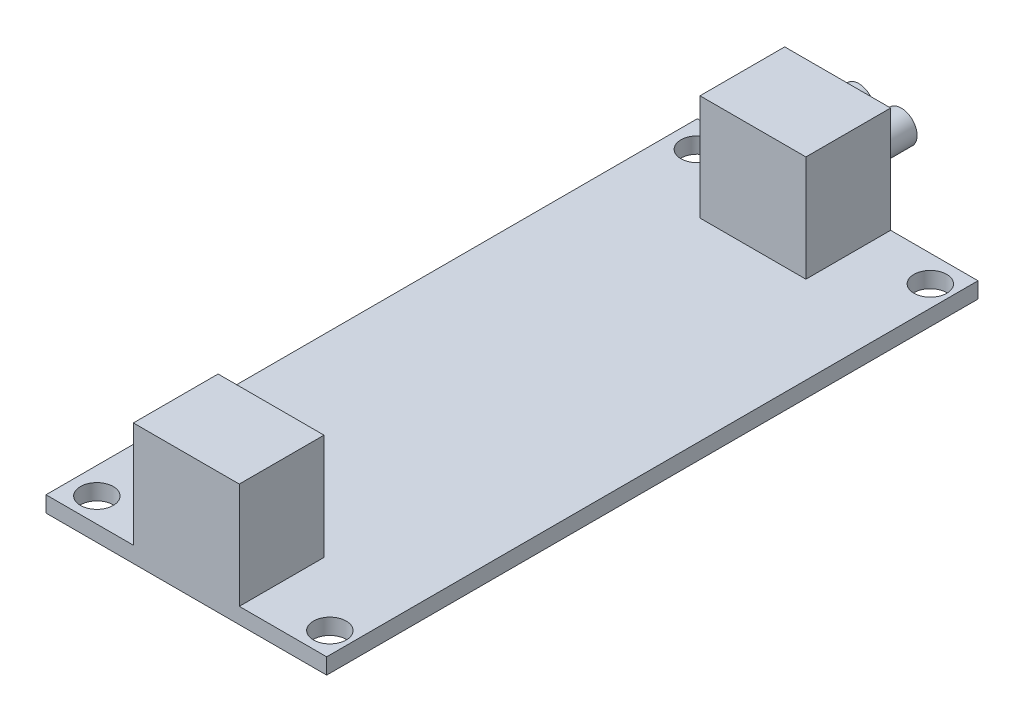
ISO-10303-21;
HEADER;
FILE_DESCRIPTION(('STEP AP214'),'2;1');
FILE_NAME('part.step','',(''),(''),'','','');
FILE_SCHEMA(('AUTOMOTIVE_DESIGN { 1 0 10303 214 1 1 1 1 }'));
ENDSEC;
DATA;
#1=APPLICATION_CONTEXT('core data for automotive mechanical design processes');
#2=APPLICATION_PROTOCOL_DEFINITION('international standard','automotive_design',2000,#1);
#3=PRODUCT_CONTEXT('',#1,'mechanical');
#4=PRODUCT('Part','Part','',(#3));
#5=PRODUCT_RELATED_PRODUCT_CATEGORY('part','',(#4));
#6=PRODUCT_DEFINITION_FORMATION('','',#4);
#7=PRODUCT_DEFINITION_CONTEXT('part definition',#1,'design');
#8=PRODUCT_DEFINITION('design','',#6,#7);
#9=PRODUCT_DEFINITION_SHAPE('','',#8);
#10=(LENGTH_UNIT() NAMED_UNIT(*) SI_UNIT(.MILLI.,.METRE.));
#11=(NAMED_UNIT(*) PLANE_ANGLE_UNIT() SI_UNIT($,.RADIAN.));
#12=(NAMED_UNIT(*) SI_UNIT($,.STERADIAN.) SOLID_ANGLE_UNIT());
#13=UNCERTAINTY_MEASURE_WITH_UNIT(LENGTH_MEASURE(1.E-05),#10,'distance_accuracy_value','');
#14=(GEOMETRIC_REPRESENTATION_CONTEXT(3) GLOBAL_UNCERTAINTY_ASSIGNED_CONTEXT((#13)) GLOBAL_UNIT_ASSIGNED_CONTEXT((#10,
#11,#12)) REPRESENTATION_CONTEXT('',''));
#15=CARTESIAN_POINT('',(0.,0.,0.));
#16=DIRECTION('',(0.,0.,1.));
#17=DIRECTION('',(1.,0.,0.));
#18=AXIS2_PLACEMENT_3D('',#15,#16,#17);
#19=CARTESIAN_POINT('',(0.,1.5,0.));
#20=DIRECTION('',(0.,1.,0.));
#21=DIRECTION('',(0.,0.,1.));
#22=AXIS2_PLACEMENT_3D('',#19,#20,#21);
#23=PLANE('',#22);
#24=CARTESIAN_POINT('',(-10.75,1.5,-28.25));
#25=DIRECTION('',(0.,1.,0.));
#26=DIRECTION('',(0.,0.,1.));
#27=AXIS2_PLACEMENT_3D('',#24,#25,#26);
#28=CIRCLE('',#27,1.55);
#29=CARTESIAN_POINT('',(-10.75,1.5,-26.7));
#30=VERTEX_POINT('',#29);
#31=EDGE_CURVE('E201',#30,#30,#28,.T.);
#32=ORIENTED_EDGE('',*,*,#31,.F.);
#33=EDGE_LOOP('',(#32));
#34=FACE_BOUND('',#33,.T.);
#35=CARTESIAN_POINT('',(11.25,1.5,28.45));
#36=DIRECTION('',(0.,1.,0.));
#37=DIRECTION('',(0.,0.,1.));
#38=AXIS2_PLACEMENT_3D('',#35,#36,#37);
#39=CIRCLE('',#38,1.55);
#40=CARTESIAN_POINT('',(11.25,1.5,30.));
#41=VERTEX_POINT('',#40);
#42=EDGE_CURVE('E207',#41,#41,#39,.T.);
#43=ORIENTED_EDGE('',*,*,#42,.F.);
#44=EDGE_LOOP('',(#43));
#45=FACE_BOUND('',#44,.T.);
#46=CARTESIAN_POINT('',(-10.75,1.5,28.45));
#47=DIRECTION('',(0.,1.,0.));
#48=DIRECTION('',(0.,0.,1.));
#49=AXIS2_PLACEMENT_3D('',#46,#47,#48);
#50=CIRCLE('',#49,1.55);
#51=CARTESIAN_POINT('',(-10.75,1.5,30.));
#52=VERTEX_POINT('',#51);
#53=EDGE_CURVE('E196',#52,#52,#50,.T.);
#54=ORIENTED_EDGE('',*,*,#53,.F.);
#55=EDGE_LOOP('',(#54));
#56=FACE_BOUND('',#55,.T.);
#57=CARTESIAN_POINT('',(11.25,1.5,-28.25));
#58=DIRECTION('',(0.,1.,0.));
#59=DIRECTION('',(0.,0.,1.));
#60=AXIS2_PLACEMENT_3D('',#57,#58,#59);
#61=CIRCLE('',#60,1.55);
#62=CARTESIAN_POINT('',(11.25,1.5,-26.7));
#63=VERTEX_POINT('',#62);
#64=EDGE_CURVE('E200',#63,#63,#61,.T.);
#65=ORIENTED_EDGE('',*,*,#64,.F.);
#66=EDGE_LOOP('',(#65));
#67=FACE_BOUND('',#66,.T.);
#68=DIRECTION('',(1.,0.,0.));
#69=VECTOR('',#68,1.);
#70=CARTESIAN_POINT('',(5.,1.5,-22.75));
#71=LINE('',#70,#69);
#72=CARTESIAN_POINT('',(-5.,1.5,-22.75));
#73=VERTEX_POINT('',#72);
#74=CARTESIAN_POINT('',(5.,1.5,-22.75));
#75=VERTEX_POINT('',#74);
#76=EDGE_CURVE('E66',#73,#75,#71,.T.);
#77=ORIENTED_EDGE('',*,*,#76,.F.);
#78=DIRECTION('',(0.,0.,1.));
#79=VECTOR('',#78,1.);
#80=CARTESIAN_POINT('',(-5.,1.5,-22.75));
#81=LINE('',#80,#79);
#82=CARTESIAN_POINT('',(-5.,1.5,-30.75));
#83=VERTEX_POINT('',#82);
#84=EDGE_CURVE('E160',#83,#73,#81,.T.);
#85=ORIENTED_EDGE('',*,*,#84,.F.);
#86=DIRECTION('',(-1.,0.,0.));
#87=VECTOR('',#86,1.);
#88=CARTESIAN_POINT('',(-13.25,1.5,-30.75));
#89=LINE('',#88,#87);
#90=CARTESIAN_POINT('',(-13.25,1.5,-30.75));
#91=VERTEX_POINT('',#90);
#92=EDGE_CURVE('E224',#83,#91,#89,.T.);
#93=ORIENTED_EDGE('',*,*,#92,.T.);
#94=DIRECTION('',(0.,0.,1.));
#95=VECTOR('',#94,1.);
#96=CARTESIAN_POINT('',(-13.25,1.5,-30.75));
#97=LINE('',#96,#95);
#98=CARTESIAN_POINT('',(-13.25,1.5,30.75));
#99=VERTEX_POINT('',#98);
#100=EDGE_CURVE('E228',#91,#99,#97,.T.);
#101=ORIENTED_EDGE('',*,*,#100,.T.);
#102=DIRECTION('',(1.,0.,0.));
#103=VECTOR('',#102,1.);
#104=CARTESIAN_POINT('',(-13.25,1.5,30.75));
#105=LINE('',#104,#103);
#106=CARTESIAN_POINT('',(-5.,1.5,30.75));
#107=VERTEX_POINT('',#106);
#108=EDGE_CURVE('E231',#99,#107,#105,.T.);
#109=ORIENTED_EDGE('',*,*,#108,.T.);
#110=DIRECTION('',(0.,0.,1.));
#111=VECTOR('',#110,1.);
#112=CARTESIAN_POINT('',(-5.,1.5,22.75));
#113=LINE('',#112,#111);
#114=CARTESIAN_POINT('',(-5.,1.5,22.75));
#115=VERTEX_POINT('',#114);
#116=EDGE_CURVE('E161',#115,#107,#113,.T.);
#117=ORIENTED_EDGE('',*,*,#116,.F.);
#118=DIRECTION('',(-1.,0.,0.));
#119=VECTOR('',#118,1.);
#120=CARTESIAN_POINT('',(5.,1.5,22.75));
#121=LINE('',#120,#119);
#122=CARTESIAN_POINT('',(5.,1.5,22.75));
#123=VERTEX_POINT('',#122);
#124=EDGE_CURVE('E174',#123,#115,#121,.T.);
#125=ORIENTED_EDGE('',*,*,#124,.F.);
#126=DIRECTION('',(0.,0.,-1.));
#127=VECTOR('',#126,1.);
#128=CARTESIAN_POINT('',(5.,1.5,22.75));
#129=LINE('',#128,#127);
#130=CARTESIAN_POINT('',(5.,1.5,30.75));
#131=VERTEX_POINT('',#130);
#132=EDGE_CURVE('E164',#131,#123,#129,.T.);
#133=ORIENTED_EDGE('',*,*,#132,.F.);
#134=CARTESIAN_POINT('',(13.25,1.5,30.75));
#135=VERTEX_POINT('',#134);
#136=EDGE_CURVE('E230',#131,#135,#105,.T.);
#137=ORIENTED_EDGE('',*,*,#136,.T.);
#138=DIRECTION('',(0.,0.,-1.));
#139=VECTOR('',#138,1.);
#140=CARTESIAN_POINT('',(13.25,1.5,-30.75));
#141=LINE('',#140,#139);
#142=CARTESIAN_POINT('',(13.25,1.5,-30.75));
#143=VERTEX_POINT('',#142);
#144=EDGE_CURVE('E221',#135,#143,#141,.T.);
#145=ORIENTED_EDGE('',*,*,#144,.T.);
#146=CARTESIAN_POINT('',(5.,1.5,-30.75));
#147=VERTEX_POINT('',#146);
#148=EDGE_CURVE('E226',#143,#147,#89,.T.);
#149=ORIENTED_EDGE('',*,*,#148,.T.);
#150=DIRECTION('',(0.,0.,-1.));
#151=VECTOR('',#150,1.);
#152=CARTESIAN_POINT('',(5.,1.5,-22.75));
#153=LINE('',#152,#151);
#154=EDGE_CURVE('E71',#75,#147,#153,.T.);
#155=ORIENTED_EDGE('',*,*,#154,.F.);
#156=EDGE_LOOP('',(#77,#85,#93,#101,#109,#117,#125,#133,#137,#145,#149,#155));
#157=FACE_BOUND('',#156,.T.);
#158=ADVANCED_FACE('F51',(#34,#45,#56,#67,#157),#23,.T.);
#159=CARTESIAN_POINT('',(13.25,1.5,-30.75));
#160=DIRECTION('',(-1.,0.,0.));
#161=DIRECTION('',(0.,0.,1.));
#162=AXIS2_PLACEMENT_3D('',#159,#160,#161);
#163=PLANE('',#162);
#164=DIRECTION('',(0.,0.,-1.));
#165=VECTOR('',#164,1.);
#166=CARTESIAN_POINT('',(13.25,0.,-30.75));
#167=LINE('',#166,#165);
#168=CARTESIAN_POINT('',(13.25,0.,30.75));
#169=VERTEX_POINT('',#168);
#170=CARTESIAN_POINT('',(13.25,0.,-30.75));
#171=VERTEX_POINT('',#170);
#172=EDGE_CURVE('E218',#169,#171,#167,.T.);
#173=ORIENTED_EDGE('',*,*,#172,.T.);
#174=DIRECTION('',(0.,-1.,0.));
#175=VECTOR('',#174,1.);
#176=CARTESIAN_POINT('',(13.25,1.5,-30.75));
#177=LINE('',#176,#175);
#178=EDGE_CURVE('E249',#143,#171,#177,.T.);
#179=ORIENTED_EDGE('',*,*,#178,.F.);
#180=ORIENTED_EDGE('',*,*,#144,.F.);
#181=DIRECTION('',(0.,-1.,0.));
#182=VECTOR('',#181,1.);
#183=CARTESIAN_POINT('',(13.25,1.5,30.75));
#184=LINE('',#183,#182);
#185=EDGE_CURVE('E233',#135,#169,#184,.T.);
#186=ORIENTED_EDGE('',*,*,#185,.T.);
#187=EDGE_LOOP('',(#173,#179,#180,#186));
#188=FACE_BOUND('',#187,.T.);
#189=ADVANCED_FACE('F53',(#188),#163,.F.);
#190=CARTESIAN_POINT('',(-13.25,1.5,-30.75));
#191=DIRECTION('',(0.,0.,1.));
#192=DIRECTION('',(1.,0.,0.));
#193=AXIS2_PLACEMENT_3D('',#190,#191,#192);
#194=PLANE('',#193);
#195=CARTESIAN_POINT('',(-2.,6.5,-30.75));
#196=DIRECTION('',(0.,0.,1.));
#197=DIRECTION('',(1.,0.,0.));
#198=AXIS2_PLACEMENT_3D('',#195,#196,#197);
#199=CIRCLE('',#198,1.5);
#200=CARTESIAN_POINT('',(-0.5,6.5,-30.75));
#201=VERTEX_POINT('',#200);
#202=EDGE_CURVE('E13',#201,#201,#199,.F.);
#203=ORIENTED_EDGE('',*,*,#202,.F.);
#204=EDGE_LOOP('',(#203));
#205=FACE_BOUND('',#204,.T.);
#206=CARTESIAN_POINT('',(2.,6.5,-30.75));
#207=DIRECTION('',(0.,0.,1.));
#208=DIRECTION('',(1.,0.,0.));
#209=AXIS2_PLACEMENT_3D('',#206,#207,#208);
#210=CIRCLE('',#209,1.5);
#211=CARTESIAN_POINT('',(3.5,6.5,-30.75));
#212=VERTEX_POINT('',#211);
#213=EDGE_CURVE('E59',#212,#212,#210,.F.);
#214=ORIENTED_EDGE('',*,*,#213,.F.);
#215=EDGE_LOOP('',(#214));
#216=FACE_BOUND('',#215,.T.);
#217=DIRECTION('',(-1.,0.,0.));
#218=VECTOR('',#217,1.);
#219=CARTESIAN_POINT('',(-13.25,0.,-30.75));
#220=LINE('',#219,#218);
#221=CARTESIAN_POINT('',(-13.25,0.,-30.75));
#222=VERTEX_POINT('',#221);
#223=EDGE_CURVE('E236',#171,#222,#220,.T.);
#224=ORIENTED_EDGE('',*,*,#223,.T.);
#225=DIRECTION('',(0.,-1.,0.));
#226=VECTOR('',#225,1.);
#227=CARTESIAN_POINT('',(-13.25,1.5,-30.75));
#228=LINE('',#227,#226);
#229=EDGE_CURVE('E246',#91,#222,#228,.T.);
#230=ORIENTED_EDGE('',*,*,#229,.F.);
#231=ORIENTED_EDGE('',*,*,#92,.F.);
#232=DIRECTION('',(0.,-1.,0.));
#233=VECTOR('',#232,1.);
#234=CARTESIAN_POINT('',(-5.,11.5,-30.75));
#235=LINE('',#234,#233);
#236=CARTESIAN_POINT('',(-5.,11.5,-30.75));
#237=VERTEX_POINT('',#236);
#238=EDGE_CURVE('E474',#237,#83,#235,.T.);
#239=ORIENTED_EDGE('',*,*,#238,.F.);
#240=DIRECTION('',(-1.,0.,0.));
#241=VECTOR('',#240,1.);
#242=CARTESIAN_POINT('',(5.,11.5,-30.75));
#243=LINE('',#242,#241);
#244=CARTESIAN_POINT('',(5.,11.5,-30.75));
#245=VERTEX_POINT('',#244);
#246=EDGE_CURVE('E154',#245,#237,#243,.T.);
#247=ORIENTED_EDGE('',*,*,#246,.F.);
#248=DIRECTION('',(0.,-1.,0.));
#249=VECTOR('',#248,1.);
#250=CARTESIAN_POINT('',(5.,11.5,-30.75));
#251=LINE('',#250,#249);
#252=EDGE_CURVE('E166',#245,#147,#251,.T.);
#253=ORIENTED_EDGE('',*,*,#252,.T.);
#254=ORIENTED_EDGE('',*,*,#148,.F.);
#255=ORIENTED_EDGE('',*,*,#178,.T.);
#256=EDGE_LOOP('',(#224,#230,#231,#239,#247,#253,#254,#255));
#257=FACE_BOUND('',#256,.T.);
#258=ADVANCED_FACE('F256',(#205,#216,#257),#194,.F.);
#259=CARTESIAN_POINT('',(-13.25,1.5,-30.75));
#260=DIRECTION('',(1.,0.,0.));
#261=DIRECTION('',(0.,0.,-1.));
#262=AXIS2_PLACEMENT_3D('',#259,#260,#261);
#263=PLANE('',#262);
#264=DIRECTION('',(0.,0.,1.));
#265=VECTOR('',#264,1.);
#266=CARTESIAN_POINT('',(-13.25,0.,-30.75));
#267=LINE('',#266,#265);
#268=CARTESIAN_POINT('',(-13.25,0.,30.75));
#269=VERTEX_POINT('',#268);
#270=EDGE_CURVE('E238',#222,#269,#267,.T.);
#271=ORIENTED_EDGE('',*,*,#270,.T.);
#272=DIRECTION('',(0.,-1.,0.));
#273=VECTOR('',#272,1.);
#274=CARTESIAN_POINT('',(-13.25,1.5,30.75));
#275=LINE('',#274,#273);
#276=EDGE_CURVE('E243',#99,#269,#275,.T.);
#277=ORIENTED_EDGE('',*,*,#276,.F.);
#278=ORIENTED_EDGE('',*,*,#100,.F.);
#279=ORIENTED_EDGE('',*,*,#229,.T.);
#280=EDGE_LOOP('',(#271,#277,#278,#279));
#281=FACE_BOUND('',#280,.T.);
#282=ADVANCED_FACE('F259',(#281),#263,.F.);
#283=CARTESIAN_POINT('',(-13.25,1.5,30.75));
#284=DIRECTION('',(0.,0.,-1.));
#285=DIRECTION('',(-1.,0.,0.));
#286=AXIS2_PLACEMENT_3D('',#283,#284,#285);
#287=PLANE('',#286);
#288=DIRECTION('',(1.,0.,0.));
#289=VECTOR('',#288,1.);
#290=CARTESIAN_POINT('',(-13.25,0.,30.75));
#291=LINE('',#290,#289);
#292=EDGE_CURVE('E225',#269,#169,#291,.T.);
#293=ORIENTED_EDGE('',*,*,#292,.T.);
#294=ORIENTED_EDGE('',*,*,#185,.F.);
#295=ORIENTED_EDGE('',*,*,#136,.F.);
#296=DIRECTION('',(0.,-1.,0.));
#297=VECTOR('',#296,1.);
#298=CARTESIAN_POINT('',(5.,11.5,30.75));
#299=LINE('',#298,#297);
#300=CARTESIAN_POINT('',(5.,11.5,30.75));
#301=VERTEX_POINT('',#300);
#302=EDGE_CURVE('E190',#301,#131,#299,.T.);
#303=ORIENTED_EDGE('',*,*,#302,.F.);
#304=DIRECTION('',(1.,0.,0.));
#305=VECTOR('',#304,1.);
#306=CARTESIAN_POINT('',(5.,11.5,30.75));
#307=LINE('',#306,#305);
#308=CARTESIAN_POINT('',(-5.,11.5,30.75));
#309=VERTEX_POINT('',#308);
#310=EDGE_CURVE('E173',#309,#301,#307,.T.);
#311=ORIENTED_EDGE('',*,*,#310,.F.);
#312=DIRECTION('',(0.,-1.,0.));
#313=VECTOR('',#312,1.);
#314=CARTESIAN_POINT('',(-5.,11.5,30.75));
#315=LINE('',#314,#313);
#316=EDGE_CURVE('E193',#309,#107,#315,.T.);
#317=ORIENTED_EDGE('',*,*,#316,.T.);
#318=ORIENTED_EDGE('',*,*,#108,.F.);
#319=ORIENTED_EDGE('',*,*,#276,.T.);
#320=EDGE_LOOP('',(#293,#294,#295,#303,#311,#317,#318,#319));
#321=FACE_BOUND('',#320,.T.);
#322=ADVANCED_FACE('F273',(#321),#287,.F.);
#323=CARTESIAN_POINT('',(0.,0.,0.));
#324=DIRECTION('',(0.,1.,0.));
#325=DIRECTION('',(0.,0.,1.));
#326=AXIS2_PLACEMENT_3D('',#323,#324,#325);
#327=PLANE('',#326);
#328=CARTESIAN_POINT('',(-10.75,0.,-28.25));
#329=DIRECTION('',(0.,1.,0.));
#330=DIRECTION('',(0.,0.,1.));
#331=AXIS2_PLACEMENT_3D('',#328,#329,#330);
#332=CIRCLE('',#331,1.55);
#333=CARTESIAN_POINT('',(-10.75,0.,-26.7));
#334=VERTEX_POINT('',#333);
#335=EDGE_CURVE('E197',#334,#334,#332,.T.);
#336=ORIENTED_EDGE('',*,*,#335,.T.);
#337=EDGE_LOOP('',(#336));
#338=FACE_BOUND('',#337,.T.);
#339=CARTESIAN_POINT('',(11.25,0.,28.45));
#340=DIRECTION('',(0.,1.,0.));
#341=DIRECTION('',(0.,0.,1.));
#342=AXIS2_PLACEMENT_3D('',#339,#340,#341);
#343=CIRCLE('',#342,1.55);
#344=CARTESIAN_POINT('',(11.25,0.,30.));
#345=VERTEX_POINT('',#344);
#346=EDGE_CURVE('E204',#345,#345,#343,.T.);
#347=ORIENTED_EDGE('',*,*,#346,.T.);
#348=EDGE_LOOP('',(#347));
#349=FACE_BOUND('',#348,.T.);
#350=CARTESIAN_POINT('',(-10.75,0.,28.45));
#351=DIRECTION('',(0.,1.,0.));
#352=DIRECTION('',(0.,0.,1.));
#353=AXIS2_PLACEMENT_3D('',#350,#351,#352);
#354=CIRCLE('',#353,1.55);
#355=CARTESIAN_POINT('',(-10.75,0.,30.));
#356=VERTEX_POINT('',#355);
#357=EDGE_CURVE('E210',#356,#356,#354,.T.);
#358=ORIENTED_EDGE('',*,*,#357,.T.);
#359=EDGE_LOOP('',(#358));
#360=FACE_BOUND('',#359,.T.);
#361=CARTESIAN_POINT('',(11.25,0.,-28.25));
#362=DIRECTION('',(0.,1.,0.));
#363=DIRECTION('',(0.,0.,1.));
#364=AXIS2_PLACEMENT_3D('',#361,#362,#363);
#365=CIRCLE('',#364,1.55);
#366=CARTESIAN_POINT('',(11.25,0.,-26.7));
#367=VERTEX_POINT('',#366);
#368=EDGE_CURVE('E215',#367,#367,#365,.T.);
#369=ORIENTED_EDGE('',*,*,#368,.T.);
#370=EDGE_LOOP('',(#369));
#371=FACE_BOUND('',#370,.T.);
#372=ORIENTED_EDGE('',*,*,#172,.F.);
#373=ORIENTED_EDGE('',*,*,#292,.F.);
#374=ORIENTED_EDGE('',*,*,#270,.F.);
#375=ORIENTED_EDGE('',*,*,#223,.F.);
#376=EDGE_LOOP('',(#372,#373,#374,#375));
#377=FACE_BOUND('',#376,.T.);
#378=ADVANCED_FACE('F270',(#338,#349,#360,#371,#377),#327,.F.);
#379=CARTESIAN_POINT('',(11.25,0.,-28.25));
#380=DIRECTION('',(0.,1.,0.));
#381=DIRECTION('',(0.,0.,1.));
#382=AXIS2_PLACEMENT_3D('',#379,#380,#381);
#383=CYLINDRICAL_SURFACE('',#382,1.55);
#384=ORIENTED_EDGE('',*,*,#368,.F.);
#385=EDGE_LOOP('',(#384));
#386=FACE_BOUND('',#385,.T.);
#387=ORIENTED_EDGE('',*,*,#64,.T.);
#388=EDGE_LOOP('',(#387));
#389=FACE_BOUND('',#388,.T.);
#390=ADVANCED_FACE('F311',(#386,#389),#383,.F.);
#391=CARTESIAN_POINT('',(-10.75,0.,28.45));
#392=DIRECTION('',(0.,1.,0.));
#393=DIRECTION('',(0.,0.,1.));
#394=AXIS2_PLACEMENT_3D('',#391,#392,#393);
#395=CYLINDRICAL_SURFACE('',#394,1.55);
#396=ORIENTED_EDGE('',*,*,#357,.F.);
#397=EDGE_LOOP('',(#396));
#398=FACE_BOUND('',#397,.T.);
#399=ORIENTED_EDGE('',*,*,#53,.T.);
#400=EDGE_LOOP('',(#399));
#401=FACE_BOUND('',#400,.T.);
#402=ADVANCED_FACE('F339',(#398,#401),#395,.F.);
#403=CARTESIAN_POINT('',(11.25,0.,28.45));
#404=DIRECTION('',(0.,1.,0.));
#405=DIRECTION('',(0.,0.,1.));
#406=AXIS2_PLACEMENT_3D('',#403,#404,#405);
#407=CYLINDRICAL_SURFACE('',#406,1.55);
#408=ORIENTED_EDGE('',*,*,#346,.F.);
#409=EDGE_LOOP('',(#408));
#410=FACE_BOUND('',#409,.T.);
#411=ORIENTED_EDGE('',*,*,#42,.T.);
#412=EDGE_LOOP('',(#411));
#413=FACE_BOUND('',#412,.T.);
#414=ADVANCED_FACE('F346',(#410,#413),#407,.F.);
#415=CARTESIAN_POINT('',(-10.75,0.,-28.25));
#416=DIRECTION('',(0.,1.,0.));
#417=DIRECTION('',(0.,0.,1.));
#418=AXIS2_PLACEMENT_3D('',#415,#416,#417);
#419=CYLINDRICAL_SURFACE('',#418,1.55);
#420=ORIENTED_EDGE('',*,*,#335,.F.);
#421=EDGE_LOOP('',(#420));
#422=FACE_BOUND('',#421,.T.);
#423=ORIENTED_EDGE('',*,*,#31,.T.);
#424=EDGE_LOOP('',(#423));
#425=FACE_BOUND('',#424,.T.);
#426=ADVANCED_FACE('F353',(#422,#425),#419,.F.);
#427=CARTESIAN_POINT('',(-5.,11.5,22.75));
#428=DIRECTION('',(1.,0.,0.));
#429=DIRECTION('',(0.,0.,-1.));
#430=AXIS2_PLACEMENT_3D('',#427,#428,#429);
#431=PLANE('',#430);
#432=ORIENTED_EDGE('',*,*,#116,.T.);
#433=ORIENTED_EDGE('',*,*,#316,.F.);
#434=DIRECTION('',(0.,0.,1.));
#435=VECTOR('',#434,1.);
#436=CARTESIAN_POINT('',(-5.,11.5,22.75));
#437=LINE('',#436,#435);
#438=CARTESIAN_POINT('',(-5.,11.5,22.75));
#439=VERTEX_POINT('',#438);
#440=EDGE_CURVE('E170',#439,#309,#437,.T.);
#441=ORIENTED_EDGE('',*,*,#440,.F.);
#442=DIRECTION('',(0.,-1.,0.));
#443=VECTOR('',#442,1.);
#444=CARTESIAN_POINT('',(-5.,11.5,22.75));
#445=LINE('',#444,#443);
#446=EDGE_CURVE('E179',#439,#115,#445,.T.);
#447=ORIENTED_EDGE('',*,*,#446,.T.);
#448=EDGE_LOOP('',(#432,#433,#441,#447));
#449=FACE_BOUND('',#448,.T.);
#450=ADVANCED_FACE('F290',(#449),#431,.F.);
#451=CARTESIAN_POINT('',(5.,11.5,22.75));
#452=DIRECTION('',(-1.,0.,0.));
#453=DIRECTION('',(0.,0.,1.));
#454=AXIS2_PLACEMENT_3D('',#451,#452,#453);
#455=PLANE('',#454);
#456=ORIENTED_EDGE('',*,*,#132,.T.);
#457=DIRECTION('',(0.,-1.,0.));
#458=VECTOR('',#457,1.);
#459=CARTESIAN_POINT('',(5.,11.5,22.75));
#460=LINE('',#459,#458);
#461=CARTESIAN_POINT('',(5.,11.5,22.75));
#462=VERTEX_POINT('',#461);
#463=EDGE_CURVE('E187',#462,#123,#460,.T.);
#464=ORIENTED_EDGE('',*,*,#463,.F.);
#465=DIRECTION('',(0.,0.,-1.));
#466=VECTOR('',#465,1.);
#467=CARTESIAN_POINT('',(5.,11.5,22.75));
#468=LINE('',#467,#466);
#469=EDGE_CURVE('E176',#301,#462,#468,.T.);
#470=ORIENTED_EDGE('',*,*,#469,.F.);
#471=ORIENTED_EDGE('',*,*,#302,.T.);
#472=EDGE_LOOP('',(#456,#464,#470,#471));
#473=FACE_BOUND('',#472,.T.);
#474=ADVANCED_FACE('F281',(#473),#455,.F.);
#475=CARTESIAN_POINT('',(5.,11.5,22.75));
#476=DIRECTION('',(0.,0.,1.));
#477=DIRECTION('',(1.,0.,0.));
#478=AXIS2_PLACEMENT_3D('',#475,#476,#477);
#479=PLANE('',#478);
#480=ORIENTED_EDGE('',*,*,#124,.T.);
#481=ORIENTED_EDGE('',*,*,#446,.F.);
#482=DIRECTION('',(-1.,0.,0.));
#483=VECTOR('',#482,1.);
#484=CARTESIAN_POINT('',(5.,11.5,22.75));
#485=LINE('',#484,#483);
#486=EDGE_CURVE('E178',#462,#439,#485,.T.);
#487=ORIENTED_EDGE('',*,*,#486,.F.);
#488=ORIENTED_EDGE('',*,*,#463,.T.);
#489=EDGE_LOOP('',(#480,#481,#487,#488));
#490=FACE_BOUND('',#489,.T.);
#491=ADVANCED_FACE('F292',(#490),#479,.F.);
#492=CARTESIAN_POINT('',(0.,11.5,0.));
#493=DIRECTION('',(0.,-1.,0.));
#494=DIRECTION('',(0.,0.,-1.));
#495=AXIS2_PLACEMENT_3D('',#492,#493,#494);
#496=PLANE('',#495);
#497=ORIENTED_EDGE('',*,*,#440,.T.);
#498=ORIENTED_EDGE('',*,*,#310,.T.);
#499=ORIENTED_EDGE('',*,*,#469,.T.);
#500=ORIENTED_EDGE('',*,*,#486,.T.);
#501=EDGE_LOOP('',(#497,#498,#499,#500));
#502=FACE_BOUND('',#501,.T.);
#503=ADVANCED_FACE('F285',(#502),#496,.F.);
#504=CARTESIAN_POINT('',(-5.,11.5,-22.75));
#505=DIRECTION('',(1.,0.,0.));
#506=DIRECTION('',(0.,0.,-1.));
#507=AXIS2_PLACEMENT_3D('',#504,#505,#506);
#508=PLANE('',#507);
#509=ORIENTED_EDGE('',*,*,#84,.T.);
#510=DIRECTION('',(0.,-1.,0.));
#511=VECTOR('',#510,1.);
#512=CARTESIAN_POINT('',(-5.,11.5,-22.75));
#513=LINE('',#512,#511);
#514=CARTESIAN_POINT('',(-5.,11.5,-22.75));
#515=VERTEX_POINT('',#514);
#516=EDGE_CURVE('E142',#515,#73,#513,.T.);
#517=ORIENTED_EDGE('',*,*,#516,.F.);
#518=DIRECTION('',(0.,0.,1.));
#519=VECTOR('',#518,1.);
#520=CARTESIAN_POINT('',(-5.,11.5,-22.75));
#521=LINE('',#520,#519);
#522=EDGE_CURVE('E149',#237,#515,#521,.T.);
#523=ORIENTED_EDGE('',*,*,#522,.F.);
#524=ORIENTED_EDGE('',*,*,#238,.T.);
#525=EDGE_LOOP('',(#509,#517,#523,#524));
#526=FACE_BOUND('',#525,.T.);
#527=ADVANCED_FACE('F159',(#526),#508,.F.);
#528=CARTESIAN_POINT('',(5.,11.5,-22.75));
#529=DIRECTION('',(0.,0.,-1.));
#530=DIRECTION('',(-1.,0.,0.));
#531=AXIS2_PLACEMENT_3D('',#528,#529,#530);
#532=PLANE('',#531);
#533=ORIENTED_EDGE('',*,*,#76,.T.);
#534=DIRECTION('',(0.,-1.,0.));
#535=VECTOR('',#534,1.);
#536=CARTESIAN_POINT('',(5.,11.5,-22.75));
#537=LINE('',#536,#535);
#538=CARTESIAN_POINT('',(5.,11.5,-22.75));
#539=VERTEX_POINT('',#538);
#540=EDGE_CURVE('E145',#539,#75,#537,.T.);
#541=ORIENTED_EDGE('',*,*,#540,.F.);
#542=DIRECTION('',(1.,0.,0.));
#543=VECTOR('',#542,1.);
#544=CARTESIAN_POINT('',(5.,11.5,-22.75));
#545=LINE('',#544,#543);
#546=EDGE_CURVE('E138',#515,#539,#545,.T.);
#547=ORIENTED_EDGE('',*,*,#546,.F.);
#548=ORIENTED_EDGE('',*,*,#516,.T.);
#549=EDGE_LOOP('',(#533,#541,#547,#548));
#550=FACE_BOUND('',#549,.T.);
#551=ADVANCED_FACE('F140',(#550),#532,.F.);
#552=CARTESIAN_POINT('',(5.,11.5,-22.75));
#553=DIRECTION('',(-1.,0.,0.));
#554=DIRECTION('',(0.,0.,1.));
#555=AXIS2_PLACEMENT_3D('',#552,#553,#554);
#556=PLANE('',#555);
#557=ORIENTED_EDGE('',*,*,#154,.T.);
#558=ORIENTED_EDGE('',*,*,#252,.F.);
#559=DIRECTION('',(0.,0.,-1.));
#560=VECTOR('',#559,1.);
#561=CARTESIAN_POINT('',(5.,11.5,-22.75));
#562=LINE('',#561,#560);
#563=EDGE_CURVE('E148',#539,#245,#562,.T.);
#564=ORIENTED_EDGE('',*,*,#563,.F.);
#565=ORIENTED_EDGE('',*,*,#540,.T.);
#566=EDGE_LOOP('',(#557,#558,#564,#565));
#567=FACE_BOUND('',#566,.T.);
#568=ADVANCED_FACE('F398',(#567),#556,.F.);
#569=CARTESIAN_POINT('',(0.,11.5,0.));
#570=DIRECTION('',(0.,1.,0.));
#571=DIRECTION('',(0.,0.,1.));
#572=AXIS2_PLACEMENT_3D('',#569,#570,#571);
#573=PLANE('',#572);
#574=ORIENTED_EDGE('',*,*,#522,.T.);
#575=ORIENTED_EDGE('',*,*,#546,.T.);
#576=ORIENTED_EDGE('',*,*,#563,.T.);
#577=ORIENTED_EDGE('',*,*,#246,.T.);
#578=EDGE_LOOP('',(#574,#575,#576,#577));
#579=FACE_BOUND('',#578,.T.);
#580=ADVANCED_FACE('F152',(#579),#573,.T.);
#581=CARTESIAN_POINT('',(2.,6.5,-34.75));
#582=DIRECTION('',(0.,0.,1.));
#583=DIRECTION('',(1.,0.,0.));
#584=AXIS2_PLACEMENT_3D('',#581,#582,#583);
#585=CYLINDRICAL_SURFACE('',#584,1.5);
#586=CARTESIAN_POINT('',(2.,6.5,-34.75));
#587=DIRECTION('',(0.,0.,-1.));
#588=DIRECTION('',(-1.,0.,0.));
#589=AXIS2_PLACEMENT_3D('',#586,#587,#588);
#590=CIRCLE('',#589,1.5);
#591=CARTESIAN_POINT('',(0.499999999999999,6.5,-34.75));
#592=VERTEX_POINT('',#591);
#593=EDGE_CURVE('E467',#592,#592,#590,.T.);
#594=ORIENTED_EDGE('',*,*,#593,.F.);
#595=EDGE_LOOP('',(#594));
#596=FACE_BOUND('',#595,.T.);
#597=ORIENTED_EDGE('',*,*,#213,.T.);
#598=EDGE_LOOP('',(#597));
#599=FACE_BOUND('',#598,.T.);
#600=ADVANCED_FACE('F254',(#596,#599),#585,.T.);
#601=CARTESIAN_POINT('',(2.,6.5,-34.75));
#602=DIRECTION('',(0.,0.,-1.));
#603=DIRECTION('',(-1.,0.,0.));
#604=AXIS2_PLACEMENT_3D('',#601,#602,#603);
#605=PLANE('',#604);
#606=ORIENTED_EDGE('',*,*,#593,.T.);
#607=EDGE_LOOP('',(#606));
#608=FACE_BOUND('',#607,.T.);
#609=ADVANCED_FACE('F430',(#608),#605,.T.);
#610=CARTESIAN_POINT('',(-2.,6.5,-34.75));
#611=DIRECTION('',(0.,0.,1.));
#612=DIRECTION('',(1.,0.,0.));
#613=AXIS2_PLACEMENT_3D('',#610,#611,#612);
#614=CYLINDRICAL_SURFACE('',#613,1.5);
#615=CARTESIAN_POINT('',(-2.,6.5,-34.75));
#616=DIRECTION('',(0.,0.,-1.));
#617=DIRECTION('',(-1.,0.,0.));
#618=AXIS2_PLACEMENT_3D('',#615,#616,#617);
#619=CIRCLE('',#618,1.5);
#620=CARTESIAN_POINT('',(-3.5,6.5,-34.75));
#621=VERTEX_POINT('',#620);
#622=EDGE_CURVE('E466',#621,#621,#619,.T.);
#623=ORIENTED_EDGE('',*,*,#622,.F.);
#624=EDGE_LOOP('',(#623));
#625=FACE_BOUND('',#624,.T.);
#626=ORIENTED_EDGE('',*,*,#202,.T.);
#627=EDGE_LOOP('',(#626));
#628=FACE_BOUND('',#627,.T.);
#629=ADVANCED_FACE('F440',(#625,#628),#614,.T.);
#630=CARTESIAN_POINT('',(-2.,6.5,-34.75));
#631=DIRECTION('',(0.,0.,-1.));
#632=DIRECTION('',(-1.,0.,0.));
#633=AXIS2_PLACEMENT_3D('',#630,#631,#632);
#634=PLANE('',#633);
#635=ORIENTED_EDGE('',*,*,#622,.T.);
#636=EDGE_LOOP('',(#635));
#637=FACE_BOUND('',#636,.T.);
#638=ADVANCED_FACE('F450',(#637),#634,.T.);
#639=CLOSED_SHELL('',(#158,#189,#258,#282,#322,#378,#390,#402,#414,#426,#450,#474,#491,#503,
#527,#551,#568,#580,#600,#609,#629,#638));
#640=MANIFOLD_SOLID_BREP('B2',#639);
#641=ADVANCED_BREP_SHAPE_REPRESENTATION('',(#18,#640),#14);
#642=SHAPE_DEFINITION_REPRESENTATION(#9,#641);
ENDSEC;
END-ISO-10303-21;
